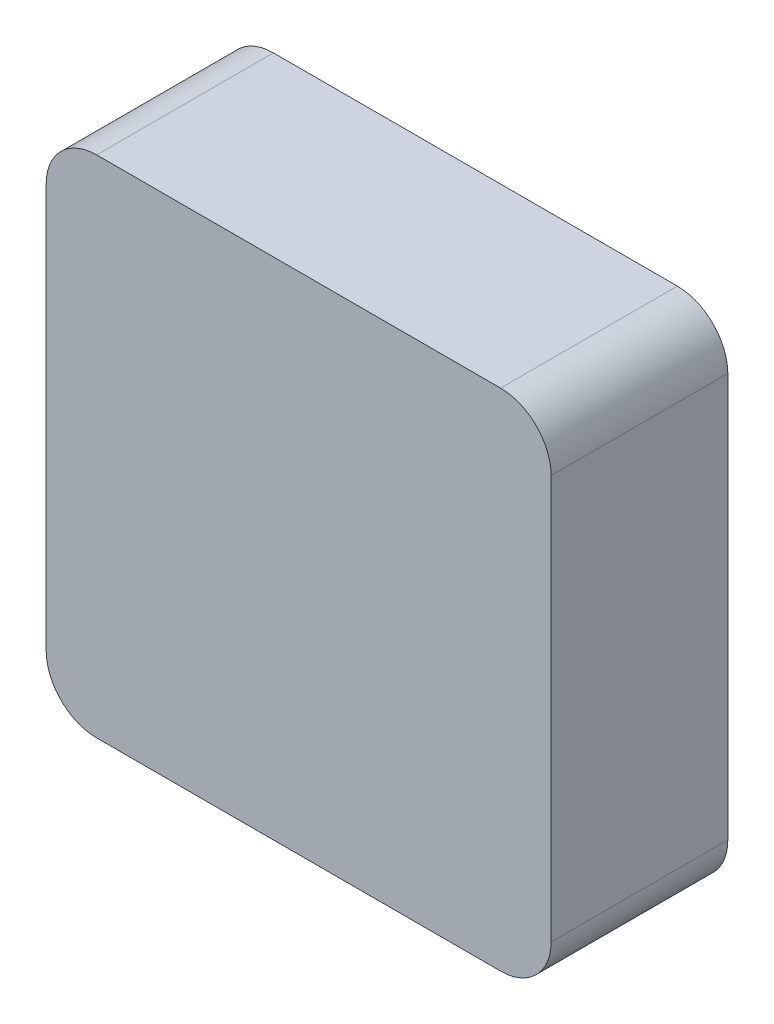
ISO-10303-21;
HEADER;
FILE_DESCRIPTION(('STEP AP214'),'2;1');
FILE_NAME('part.step','',(''),(''),'','','');
FILE_SCHEMA(('AUTOMOTIVE_DESIGN { 1 0 10303 214 1 1 1 1 }'));
ENDSEC;
DATA;
#1=APPLICATION_CONTEXT('core data for automotive mechanical design processes');
#2=APPLICATION_PROTOCOL_DEFINITION('international standard','automotive_design',2000,#1);
#3=PRODUCT_CONTEXT('',#1,'mechanical');
#4=PRODUCT('Part','Part','',(#3));
#5=PRODUCT_RELATED_PRODUCT_CATEGORY('part','',(#4));
#6=PRODUCT_DEFINITION_FORMATION('','',#4);
#7=PRODUCT_DEFINITION_CONTEXT('part definition',#1,'design');
#8=PRODUCT_DEFINITION('design','',#6,#7);
#9=PRODUCT_DEFINITION_SHAPE('','',#8);
#10=(LENGTH_UNIT() NAMED_UNIT(*) SI_UNIT(.MILLI.,.METRE.));
#11=(NAMED_UNIT(*) PLANE_ANGLE_UNIT() SI_UNIT($,.RADIAN.));
#12=(NAMED_UNIT(*) SI_UNIT($,.STERADIAN.) SOLID_ANGLE_UNIT());
#13=UNCERTAINTY_MEASURE_WITH_UNIT(LENGTH_MEASURE(1.E-05),#10,'distance_accuracy_value','');
#14=(GEOMETRIC_REPRESENTATION_CONTEXT(3) GLOBAL_UNCERTAINTY_ASSIGNED_CONTEXT((#13)) GLOBAL_UNIT_ASSIGNED_CONTEXT((#10,
#11,#12)) REPRESENTATION_CONTEXT('',''));
#15=CARTESIAN_POINT('',(0.,0.,0.));
#16=DIRECTION('',(0.,0.,1.));
#17=DIRECTION('',(1.,0.,0.));
#18=AXIS2_PLACEMENT_3D('',#15,#16,#17);
#19=CARTESIAN_POINT('',(0.,0.,35.));
#20=DIRECTION('',(1.,0.,0.));
#21=DIRECTION('',(0.,0.,-1.));
#22=AXIS2_PLACEMENT_3D('',#19,#20,#21);
#23=PLANE('',#22);
#24=DIRECTION('',(0.,-1.,0.));
#25=VECTOR('',#24,1.);
#26=CARTESIAN_POINT('',(0.,0.,35.));
#27=LINE('',#26,#25);
#28=CARTESIAN_POINT('',(0.,90.,35.));
#29=VERTEX_POINT('',#28);
#30=CARTESIAN_POINT('',(0.,10.,35.));
#31=VERTEX_POINT('',#30);
#32=EDGE_CURVE('E335',#29,#31,#27,.T.);
#33=ORIENTED_EDGE('',*,*,#32,.F.);
#34=DIRECTION('',(0.,0.,-1.));
#35=VECTOR('',#34,1.);
#36=CARTESIAN_POINT('',(0.,90.,35.));
#37=LINE('',#36,#35);
#38=CARTESIAN_POINT('',(0.,90.,0.));
#39=VERTEX_POINT('',#38);
#40=EDGE_CURVE('E360',#29,#39,#37,.T.);
#41=ORIENTED_EDGE('',*,*,#40,.T.);
#42=DIRECTION('',(0.,-1.,0.));
#43=VECTOR('',#42,1.);
#44=CARTESIAN_POINT('',(0.,0.,0.));
#45=LINE('',#44,#43);
#46=CARTESIAN_POINT('',(0.,10.,0.));
#47=VERTEX_POINT('',#46);
#48=EDGE_CURVE('E328',#39,#47,#45,.T.);
#49=ORIENTED_EDGE('',*,*,#48,.T.);
#50=DIRECTION('',(0.,0.,-1.));
#51=VECTOR('',#50,1.);
#52=CARTESIAN_POINT('',(0.,10.,35.));
#53=LINE('',#52,#51);
#54=EDGE_CURVE('E348',#47,#31,#53,.F.);
#55=ORIENTED_EDGE('',*,*,#54,.T.);
#56=EDGE_LOOP('',(#33,#41,#49,#55));
#57=FACE_BOUND('',#56,.T.);
#58=ADVANCED_FACE('F39',(#57),#23,.F.);
#59=CARTESIAN_POINT('',(0.,0.,35.));
#60=DIRECTION('',(0.,1.,0.));
#61=DIRECTION('',(0.,0.,1.));
#62=AXIS2_PLACEMENT_3D('',#59,#60,#61);
#63=PLANE('',#62);
#64=DIRECTION('',(1.,0.,0.));
#65=VECTOR('',#64,1.);
#66=CARTESIAN_POINT('',(19.2242024894603,0.,14.1517072152888));
#67=LINE('',#66,#65);
#68=CARTESIAN_POINT('',(19.2242024894603,0.,14.1517072152888));
#69=VERTEX_POINT('',#68);
#70=CARTESIAN_POINT('',(30.1952043797916,0.,14.1517072152888));
#71=VERTEX_POINT('',#70);
#72=EDGE_CURVE('E257',#69,#71,#67,.T.);
#73=ORIENTED_EDGE('',*,*,#72,.F.);
#74=DIRECTION('',(0.,0.,-1.));
#75=VECTOR('',#74,1.);
#76=CARTESIAN_POINT('',(19.2242024894603,0.,22.9380074304892));
#77=LINE('',#76,#75);
#78=CARTESIAN_POINT('',(19.2242024894603,0.,22.9380074304892));
#79=VERTEX_POINT('',#78);
#80=EDGE_CURVE('E54',#79,#69,#77,.T.);
#81=ORIENTED_EDGE('',*,*,#80,.F.);
#82=DIRECTION('',(-1.,0.,0.));
#83=VECTOR('',#82,1.);
#84=CARTESIAN_POINT('',(19.2242024894603,0.,22.9380074304892));
#85=LINE('',#84,#83);
#86=CARTESIAN_POINT('',(30.1952043797916,0.,22.9380074304892));
#87=VERTEX_POINT('',#86);
#88=EDGE_CURVE('E246',#87,#79,#85,.T.);
#89=ORIENTED_EDGE('',*,*,#88,.F.);
#90=DIRECTION('',(0.,0.,1.));
#91=VECTOR('',#90,1.);
#92=CARTESIAN_POINT('',(30.1952043797916,0.,22.9380074304892));
#93=LINE('',#92,#91);
#94=EDGE_CURVE('E261',#71,#87,#93,.T.);
#95=ORIENTED_EDGE('',*,*,#94,.F.);
#96=EDGE_LOOP('',(#73,#81,#89,#95));
#97=FACE_BOUND('',#96,.T.);
#98=DIRECTION('',(1.,0.,0.));
#99=VECTOR('',#98,1.);
#100=CARTESIAN_POINT('',(69.0448993853803,0.,14.3416812739959));
#101=LINE('',#100,#99);
#102=CARTESIAN_POINT('',(69.0448993853803,0.,14.3416812739959));
#103=VERTEX_POINT('',#102);
#104=CARTESIAN_POINT('',(80.3008623637721,0.,14.3416812739959));
#105=VERTEX_POINT('',#104);
#106=EDGE_CURVE('E289',#103,#105,#101,.T.);
#107=ORIENTED_EDGE('',*,*,#106,.F.);
#108=DIRECTION('',(0.,0.,-1.));
#109=VECTOR('',#108,1.);
#110=CARTESIAN_POINT('',(69.0448993853803,0.,17.4287597279852));
#111=LINE('',#110,#109);
#112=CARTESIAN_POINT('',(69.0448993853803,0.,17.4287597279852));
#113=VERTEX_POINT('',#112);
#114=EDGE_CURVE('E62',#113,#103,#111,.T.);
#115=ORIENTED_EDGE('',*,*,#114,.F.);
#116=DIRECTION('',(-1.,0.,0.));
#117=VECTOR('',#116,1.);
#118=CARTESIAN_POINT('',(69.0448993853803,0.,17.4287597279852));
#119=LINE('',#118,#117);
#120=CARTESIAN_POINT('',(80.3008623637721,0.,17.4287597279852));
#121=VERTEX_POINT('',#120);
#122=EDGE_CURVE('E278',#121,#113,#119,.T.);
#123=ORIENTED_EDGE('',*,*,#122,.F.);
#124=DIRECTION('',(0.,0.,1.));
#125=VECTOR('',#124,1.);
#126=CARTESIAN_POINT('',(80.3008623637721,0.,17.4287597279852));
#127=LINE('',#126,#125);
#128=EDGE_CURVE('E292',#105,#121,#127,.T.);
#129=ORIENTED_EDGE('',*,*,#128,.F.);
#130=EDGE_LOOP('',(#107,#115,#123,#129));
#131=FACE_BOUND('',#130,.T.);
#132=DIRECTION('',(1.,0.,0.));
#133=VECTOR('',#132,1.);
#134=CARTESIAN_POINT('',(55.3667671584737,0.,14.1517072152888));
#135=LINE('',#134,#133);
#136=CARTESIAN_POINT('',(55.3667671584737,0.,14.1517072152888));
#137=VERTEX_POINT('',#136);
#138=CARTESIAN_POINT('',(65.3878987552698,0.,14.1517072152888));
#139=VERTEX_POINT('',#138);
#140=EDGE_CURVE('E233',#137,#139,#135,.T.);
#141=ORIENTED_EDGE('',*,*,#140,.F.);
#142=DIRECTION('',(0.,0.,-1.));
#143=VECTOR('',#142,1.);
#144=CARTESIAN_POINT('',(55.3667671584737,0.,17.1912921546014));
#145=LINE('',#144,#143);
#146=CARTESIAN_POINT('',(55.3667671584737,0.,17.1912921546014));
#147=VERTEX_POINT('',#146);
#148=EDGE_CURVE('E207',#147,#137,#145,.T.);
#149=ORIENTED_EDGE('',*,*,#148,.F.);
#150=DIRECTION('',(-1.,0.,0.));
#151=VECTOR('',#150,1.);
#152=CARTESIAN_POINT('',(55.3667671584737,0.,17.1912921546014));
#153=LINE('',#152,#151);
#154=CARTESIAN_POINT('',(65.3878987552698,0.,17.1912921546014));
#155=VERTEX_POINT('',#154);
#156=EDGE_CURVE('E224',#155,#147,#153,.T.);
#157=ORIENTED_EDGE('',*,*,#156,.F.);
#158=DIRECTION('',(0.,0.,1.));
#159=VECTOR('',#158,1.);
#160=CARTESIAN_POINT('',(65.3878987552698,0.,17.1912921546014));
#161=LINE('',#160,#159);
#162=EDGE_CURVE('E227',#139,#155,#161,.T.);
#163=ORIENTED_EDGE('',*,*,#162,.F.);
#164=EDGE_LOOP('',(#141,#149,#157,#163));
#165=FACE_BOUND('',#164,.T.);
#166=DIRECTION('',(1.,0.,0.));
#167=VECTOR('',#166,1.);
#168=CARTESIAN_POINT('',(39.6464138004666,0.,14.0567201859353));
#169=LINE('',#168,#167);
#170=CARTESIAN_POINT('',(39.6464138004666,0.,14.0567201859353));
#171=VERTEX_POINT('',#170);
#172=CARTESIAN_POINT('',(49.0501297064648,0.,14.0567201859353));
#173=VERTEX_POINT('',#172);
#174=EDGE_CURVE('E318',#171,#173,#169,.T.);
#175=ORIENTED_EDGE('',*,*,#174,.F.);
#176=DIRECTION('',(0.,0.,-1.));
#177=VECTOR('',#176,1.);
#178=CARTESIAN_POINT('',(39.6464138004666,0.,18.4261235361971));
#179=LINE('',#178,#177);
#180=CARTESIAN_POINT('',(39.6464138004666,0.,18.4261235361971));
#181=VERTEX_POINT('',#180);
#182=EDGE_CURVE('E268',#181,#171,#179,.T.);
#183=ORIENTED_EDGE('',*,*,#182,.F.);
#184=DIRECTION('',(-1.,0.,0.));
#185=VECTOR('',#184,1.);
#186=CARTESIAN_POINT('',(39.6464138004666,0.,18.4261235361971));
#187=LINE('',#186,#185);
#188=CARTESIAN_POINT('',(49.0501297064648,0.,18.4261235361971));
#189=VERTEX_POINT('',#188);
#190=EDGE_CURVE('E307',#189,#181,#187,.T.);
#191=ORIENTED_EDGE('',*,*,#190,.F.);
#192=DIRECTION('',(0.,0.,1.));
#193=VECTOR('',#192,1.);
#194=CARTESIAN_POINT('',(49.0501297064648,0.,18.4261235361971));
#195=LINE('',#194,#193);
#196=EDGE_CURVE('E321',#173,#189,#195,.T.);
#197=ORIENTED_EDGE('',*,*,#196,.F.);
#198=EDGE_LOOP('',(#175,#183,#191,#197));
#199=FACE_BOUND('',#198,.T.);
#200=DIRECTION('',(1.,0.,0.));
#201=VECTOR('',#200,1.);
#202=CARTESIAN_POINT('',(0.,0.,35.));
#203=LINE('',#202,#201);
#204=CARTESIAN_POINT('',(10.,0.,35.));
#205=VERTEX_POINT('',#204);
#206=CARTESIAN_POINT('',(90.,0.,35.));
#207=VERTEX_POINT('',#206);
#208=EDGE_CURVE('E338',#205,#207,#203,.T.);
#209=ORIENTED_EDGE('',*,*,#208,.F.);
#210=DIRECTION('',(0.,0.,-1.));
#211=VECTOR('',#210,1.);
#212=CARTESIAN_POINT('',(10.,0.,35.));
#213=LINE('',#212,#211);
#214=CARTESIAN_POINT('',(10.,0.,0.));
#215=VERTEX_POINT('',#214);
#216=EDGE_CURVE('E386',#205,#215,#213,.T.);
#217=ORIENTED_EDGE('',*,*,#216,.T.);
#218=DIRECTION('',(1.,0.,0.));
#219=VECTOR('',#218,1.);
#220=CARTESIAN_POINT('',(0.,0.,0.));
#221=LINE('',#220,#219);
#222=CARTESIAN_POINT('',(90.,0.,0.));
#223=VERTEX_POINT('',#222);
#224=EDGE_CURVE('E351',#215,#223,#221,.T.);
#225=ORIENTED_EDGE('',*,*,#224,.T.);
#226=DIRECTION('',(0.,0.,-1.));
#227=VECTOR('',#226,1.);
#228=CARTESIAN_POINT('',(90.,0.,35.));
#229=LINE('',#228,#227);
#230=EDGE_CURVE('E384',#223,#207,#229,.F.);
#231=ORIENTED_EDGE('',*,*,#230,.T.);
#232=EDGE_LOOP('',(#209,#217,#225,#231));
#233=FACE_BOUND('',#232,.T.);
#234=ADVANCED_FACE('F422',(#97,#131,#165,#199,#233),#63,.F.);
#235=CARTESIAN_POINT('',(100.,0.,35.));
#236=DIRECTION('',(-1.,0.,0.));
#237=DIRECTION('',(0.,0.,1.));
#238=AXIS2_PLACEMENT_3D('',#235,#236,#237);
#239=PLANE('',#238);
#240=DIRECTION('',(0.,1.,0.));
#241=VECTOR('',#240,1.);
#242=CARTESIAN_POINT('',(100.,0.,35.));
#243=LINE('',#242,#241);
#244=CARTESIAN_POINT('',(100.,10.,35.));
#245=VERTEX_POINT('',#244);
#246=CARTESIAN_POINT('',(100.,90.,35.));
#247=VERTEX_POINT('',#246);
#248=EDGE_CURVE('E342',#245,#247,#243,.T.);
#249=ORIENTED_EDGE('',*,*,#248,.F.);
#250=DIRECTION('',(0.,0.,-1.));
#251=VECTOR('',#250,1.);
#252=CARTESIAN_POINT('',(100.,10.,35.));
#253=LINE('',#252,#251);
#254=CARTESIAN_POINT('',(100.,10.,0.));
#255=VERTEX_POINT('',#254);
#256=EDGE_CURVE('E11',#245,#255,#253,.T.);
#257=ORIENTED_EDGE('',*,*,#256,.T.);
#258=DIRECTION('',(0.,1.,0.));
#259=VECTOR('',#258,1.);
#260=CARTESIAN_POINT('',(100.,0.,0.));
#261=LINE('',#260,#259);
#262=CARTESIAN_POINT('',(100.,90.,0.));
#263=VERTEX_POINT('',#262);
#264=EDGE_CURVE('E354',#255,#263,#261,.T.);
#265=ORIENTED_EDGE('',*,*,#264,.T.);
#266=DIRECTION('',(0.,0.,-1.));
#267=VECTOR('',#266,1.);
#268=CARTESIAN_POINT('',(100.,90.,35.));
#269=LINE('',#268,#267);
#270=EDGE_CURVE('E47',#263,#247,#269,.F.);
#271=ORIENTED_EDGE('',*,*,#270,.T.);
#272=EDGE_LOOP('',(#249,#257,#265,#271));
#273=FACE_BOUND('',#272,.T.);
#274=ADVANCED_FACE('F391',(#273),#239,.F.);
#275=CARTESIAN_POINT('',(0.,100.,35.));
#276=DIRECTION('',(0.,-1.,0.));
#277=DIRECTION('',(0.,0.,-1.));
#278=AXIS2_PLACEMENT_3D('',#275,#276,#277);
#279=PLANE('',#278);
#280=DIRECTION('',(-1.,0.,0.));
#281=VECTOR('',#280,1.);
#282=CARTESIAN_POINT('',(0.,100.,0.));
#283=LINE('',#282,#281);
#284=CARTESIAN_POINT('',(90.,100.,0.));
#285=VERTEX_POINT('',#284);
#286=CARTESIAN_POINT('',(10.,100.,0.));
#287=VERTEX_POINT('',#286);
#288=EDGE_CURVE('E339',#285,#287,#283,.T.);
#289=ORIENTED_EDGE('',*,*,#288,.T.);
#290=DIRECTION('',(0.,0.,-1.));
#291=VECTOR('',#290,1.);
#292=CARTESIAN_POINT('',(10.,100.,35.));
#293=LINE('',#292,#291);
#294=CARTESIAN_POINT('',(10.,100.,35.));
#295=VERTEX_POINT('',#294);
#296=EDGE_CURVE('E374',#287,#295,#293,.F.);
#297=ORIENTED_EDGE('',*,*,#296,.T.);
#298=DIRECTION('',(-1.,0.,0.));
#299=VECTOR('',#298,1.);
#300=CARTESIAN_POINT('',(0.,100.,35.));
#301=LINE('',#300,#299);
#302=CARTESIAN_POINT('',(90.,100.,35.));
#303=VERTEX_POINT('',#302);
#304=EDGE_CURVE('E345',#303,#295,#301,.T.);
#305=ORIENTED_EDGE('',*,*,#304,.F.);
#306=DIRECTION('',(0.,0.,-1.));
#307=VECTOR('',#306,1.);
#308=CARTESIAN_POINT('',(90.,100.,35.));
#309=LINE('',#308,#307);
#310=EDGE_CURVE('E371',#303,#285,#309,.T.);
#311=ORIENTED_EDGE('',*,*,#310,.T.);
#312=EDGE_LOOP('',(#289,#297,#305,#311));
#313=FACE_BOUND('',#312,.T.);
#314=ADVANCED_FACE('F403',(#313),#279,.F.);
#315=CARTESIAN_POINT('',(0.,0.,35.));
#316=DIRECTION('',(0.,0.,-1.));
#317=DIRECTION('',(-1.,0.,0.));
#318=AXIS2_PLACEMENT_3D('',#315,#316,#317);
#319=PLANE('',#318);
#320=ORIENTED_EDGE('',*,*,#304,.T.);
#321=CARTESIAN_POINT('',(10.,90.,35.));
#322=DIRECTION('',(0.,0.,-1.));
#323=DIRECTION('',(-1.,0.,0.));
#324=AXIS2_PLACEMENT_3D('',#321,#322,#323);
#325=CIRCLE('',#324,10.);
#326=EDGE_CURVE('E382',#295,#29,#325,.F.);
#327=ORIENTED_EDGE('',*,*,#326,.T.);
#328=ORIENTED_EDGE('',*,*,#32,.T.);
#329=CARTESIAN_POINT('',(10.,10.,35.));
#330=DIRECTION('',(0.,0.,-1.));
#331=DIRECTION('',(-1.,0.,0.));
#332=AXIS2_PLACEMENT_3D('',#329,#330,#331);
#333=CIRCLE('',#332,10.);
#334=EDGE_CURVE('E380',#31,#205,#333,.F.);
#335=ORIENTED_EDGE('',*,*,#334,.T.);
#336=ORIENTED_EDGE('',*,*,#208,.T.);
#337=CARTESIAN_POINT('',(90.,10.,35.));
#338=DIRECTION('',(0.,0.,-1.));
#339=DIRECTION('',(-1.,0.,0.));
#340=AXIS2_PLACEMENT_3D('',#337,#338,#339);
#341=CIRCLE('',#340,10.);
#342=EDGE_CURVE('E378',#207,#245,#341,.F.);
#343=ORIENTED_EDGE('',*,*,#342,.T.);
#344=ORIENTED_EDGE('',*,*,#248,.T.);
#345=CARTESIAN_POINT('',(90.,90.,35.));
#346=DIRECTION('',(0.,0.,-1.));
#347=DIRECTION('',(-1.,0.,0.));
#348=AXIS2_PLACEMENT_3D('',#345,#346,#347);
#349=CIRCLE('',#348,10.);
#350=EDGE_CURVE('E376',#247,#303,#349,.F.);
#351=ORIENTED_EDGE('',*,*,#350,.T.);
#352=EDGE_LOOP('',(#320,#327,#328,#335,#336,#343,#344,#351));
#353=FACE_BOUND('',#352,.T.);
#354=ADVANCED_FACE('F397',(#353),#319,.F.);
#355=CARTESIAN_POINT('',(0.,0.,0.));
#356=DIRECTION('',(0.,0.,-1.));
#357=DIRECTION('',(-1.,0.,0.));
#358=AXIS2_PLACEMENT_3D('',#355,#356,#357);
#359=PLANE('',#358);
#360=ORIENTED_EDGE('',*,*,#48,.F.);
#361=CARTESIAN_POINT('',(10.,90.,0.));
#362=DIRECTION('',(0.,0.,-1.));
#363=DIRECTION('',(-1.,0.,0.));
#364=AXIS2_PLACEMENT_3D('',#361,#362,#363);
#365=CIRCLE('',#364,10.);
#366=EDGE_CURVE('E369',#39,#287,#365,.T.);
#367=ORIENTED_EDGE('',*,*,#366,.T.);
#368=ORIENTED_EDGE('',*,*,#288,.F.);
#369=CARTESIAN_POINT('',(90.,90.,0.));
#370=DIRECTION('',(0.,0.,-1.));
#371=DIRECTION('',(-1.,0.,0.));
#372=AXIS2_PLACEMENT_3D('',#369,#370,#371);
#373=CIRCLE('',#372,10.);
#374=EDGE_CURVE('E363',#285,#263,#373,.T.);
#375=ORIENTED_EDGE('',*,*,#374,.T.);
#376=ORIENTED_EDGE('',*,*,#264,.F.);
#377=CARTESIAN_POINT('',(90.,10.,0.));
#378=DIRECTION('',(0.,0.,-1.));
#379=DIRECTION('',(-1.,0.,0.));
#380=AXIS2_PLACEMENT_3D('',#377,#378,#379);
#381=CIRCLE('',#380,10.);
#382=EDGE_CURVE('E365',#255,#223,#381,.T.);
#383=ORIENTED_EDGE('',*,*,#382,.T.);
#384=ORIENTED_EDGE('',*,*,#224,.F.);
#385=CARTESIAN_POINT('',(10.,10.,0.));
#386=DIRECTION('',(0.,0.,-1.));
#387=DIRECTION('',(-1.,0.,0.));
#388=AXIS2_PLACEMENT_3D('',#385,#386,#387);
#389=CIRCLE('',#388,10.);
#390=EDGE_CURVE('E367',#215,#47,#389,.T.);
#391=ORIENTED_EDGE('',*,*,#390,.T.);
#392=EDGE_LOOP('',(#360,#367,#368,#375,#376,#383,#384,#391));
#393=FACE_BOUND('',#392,.T.);
#394=ADVANCED_FACE('F407',(#393),#359,.T.);
#395=CARTESIAN_POINT('',(10.,90.,35.));
#396=DIRECTION('',(0.,0.,-1.));
#397=DIRECTION('',(-1.,0.,0.));
#398=AXIS2_PLACEMENT_3D('',#395,#396,#397);
#399=CYLINDRICAL_SURFACE('',#398,10.);
#400=ORIENTED_EDGE('',*,*,#326,.F.);
#401=ORIENTED_EDGE('',*,*,#296,.F.);
#402=ORIENTED_EDGE('',*,*,#366,.F.);
#403=ORIENTED_EDGE('',*,*,#40,.F.);
#404=EDGE_LOOP('',(#400,#401,#402,#403));
#405=FACE_BOUND('',#404,.T.);
#406=ADVANCED_FACE('F411',(#405),#399,.T.);
#407=CARTESIAN_POINT('',(10.,10.,35.));
#408=DIRECTION('',(0.,0.,-1.));
#409=DIRECTION('',(-1.,0.,0.));
#410=AXIS2_PLACEMENT_3D('',#407,#408,#409);
#411=CYLINDRICAL_SURFACE('',#410,10.);
#412=ORIENTED_EDGE('',*,*,#334,.F.);
#413=ORIENTED_EDGE('',*,*,#54,.F.);
#414=ORIENTED_EDGE('',*,*,#390,.F.);
#415=ORIENTED_EDGE('',*,*,#216,.F.);
#416=EDGE_LOOP('',(#412,#413,#414,#415));
#417=FACE_BOUND('',#416,.T.);
#418=ADVANCED_FACE('F419',(#417),#411,.T.);
#419=CARTESIAN_POINT('',(90.,10.,35.));
#420=DIRECTION('',(0.,0.,-1.));
#421=DIRECTION('',(-1.,0.,0.));
#422=AXIS2_PLACEMENT_3D('',#419,#420,#421);
#423=CYLINDRICAL_SURFACE('',#422,10.);
#424=ORIENTED_EDGE('',*,*,#342,.F.);
#425=ORIENTED_EDGE('',*,*,#230,.F.);
#426=ORIENTED_EDGE('',*,*,#382,.F.);
#427=ORIENTED_EDGE('',*,*,#256,.F.);
#428=EDGE_LOOP('',(#424,#425,#426,#427));
#429=FACE_BOUND('',#428,.T.);
#430=ADVANCED_FACE('F425',(#429),#423,.T.);
#431=CARTESIAN_POINT('',(90.,90.,35.));
#432=DIRECTION('',(0.,0.,-1.));
#433=DIRECTION('',(-1.,0.,0.));
#434=AXIS2_PLACEMENT_3D('',#431,#432,#433);
#435=CYLINDRICAL_SURFACE('',#434,10.);
#436=ORIENTED_EDGE('',*,*,#350,.F.);
#437=ORIENTED_EDGE('',*,*,#270,.F.);
#438=ORIENTED_EDGE('',*,*,#374,.F.);
#439=ORIENTED_EDGE('',*,*,#310,.F.);
#440=EDGE_LOOP('',(#436,#437,#438,#439));
#441=FACE_BOUND('',#440,.T.);
#442=ADVANCED_FACE('F41',(#441),#435,.T.);
#443=CARTESIAN_POINT('',(39.6464138004666,5.,18.4261235361971));
#444=DIRECTION('',(-1.,0.,0.));
#445=DIRECTION('',(0.,0.,1.));
#446=AXIS2_PLACEMENT_3D('',#443,#444,#445);
#447=PLANE('',#446);
#448=ORIENTED_EDGE('',*,*,#182,.T.);
#449=DIRECTION('',(0.,-1.,0.));
#450=VECTOR('',#449,1.);
#451=CARTESIAN_POINT('',(39.6464138004666,5.,14.0567201859353));
#452=LINE('',#451,#450);
#453=CARTESIAN_POINT('',(39.6464138004666,5.,14.0567201859353));
#454=VERTEX_POINT('',#453);
#455=EDGE_CURVE('E316',#454,#171,#452,.T.);
#456=ORIENTED_EDGE('',*,*,#455,.F.);
#457=DIRECTION('',(0.,0.,-1.));
#458=VECTOR('',#457,1.);
#459=CARTESIAN_POINT('',(39.6464138004666,5.,18.4261235361971));
#460=LINE('',#459,#458);
#461=CARTESIAN_POINT('',(39.6464138004666,5.,18.4261235361971));
#462=VERTEX_POINT('',#461);
#463=EDGE_CURVE('E303',#462,#454,#460,.T.);
#464=ORIENTED_EDGE('',*,*,#463,.F.);
#465=DIRECTION('',(0.,-1.,0.));
#466=VECTOR('',#465,1.);
#467=CARTESIAN_POINT('',(39.6464138004666,5.,18.4261235361971));
#468=LINE('',#467,#466);
#469=EDGE_CURVE('E326',#462,#181,#468,.T.);
#470=ORIENTED_EDGE('',*,*,#469,.T.);
#471=EDGE_LOOP('',(#448,#456,#464,#470));
#472=FACE_BOUND('',#471,.T.);
#473=ADVANCED_FACE('F431',(#472),#447,.F.);
#474=CARTESIAN_POINT('',(39.6464138004666,5.,18.4261235361971));
#475=DIRECTION('',(0.,0.,1.));
#476=DIRECTION('',(1.,0.,0.));
#477=AXIS2_PLACEMENT_3D('',#474,#475,#476);
#478=PLANE('',#477);
#479=ORIENTED_EDGE('',*,*,#190,.T.);
#480=ORIENTED_EDGE('',*,*,#469,.F.);
#481=DIRECTION('',(-1.,0.,0.));
#482=VECTOR('',#481,1.);
#483=CARTESIAN_POINT('',(39.6464138004666,5.,18.4261235361971));
#484=LINE('',#483,#482);
#485=CARTESIAN_POINT('',(49.0501297064648,5.,18.4261235361971));
#486=VERTEX_POINT('',#485);
#487=EDGE_CURVE('E313',#486,#462,#484,.T.);
#488=ORIENTED_EDGE('',*,*,#487,.F.);
#489=DIRECTION('',(0.,-1.,0.));
#490=VECTOR('',#489,1.);
#491=CARTESIAN_POINT('',(49.0501297064648,5.,18.4261235361971));
#492=LINE('',#491,#490);
#493=EDGE_CURVE('E329',#486,#189,#492,.T.);
#494=ORIENTED_EDGE('',*,*,#493,.T.);
#495=EDGE_LOOP('',(#479,#480,#488,#494));
#496=FACE_BOUND('',#495,.T.);
#497=ADVANCED_FACE('F505',(#496),#478,.F.);
#498=CARTESIAN_POINT('',(49.0501297064648,5.,18.4261235361971));
#499=DIRECTION('',(1.,0.,0.));
#500=DIRECTION('',(0.,0.,-1.));
#501=AXIS2_PLACEMENT_3D('',#498,#499,#500);
#502=PLANE('',#501);
#503=ORIENTED_EDGE('',*,*,#196,.T.);
#504=ORIENTED_EDGE('',*,*,#493,.F.);
#505=DIRECTION('',(0.,0.,1.));
#506=VECTOR('',#505,1.);
#507=CARTESIAN_POINT('',(49.0501297064648,5.,18.4261235361971));
#508=LINE('',#507,#506);
#509=CARTESIAN_POINT('',(49.0501297064648,5.,14.0567201859353));
#510=VERTEX_POINT('',#509);
#511=EDGE_CURVE('E310',#510,#486,#508,.T.);
#512=ORIENTED_EDGE('',*,*,#511,.F.);
#513=DIRECTION('',(0.,-1.,0.));
#514=VECTOR('',#513,1.);
#515=CARTESIAN_POINT('',(49.0501297064648,5.,14.0567201859353));
#516=LINE('',#515,#514);
#517=EDGE_CURVE('E331',#510,#173,#516,.T.);
#518=ORIENTED_EDGE('',*,*,#517,.T.);
#519=EDGE_LOOP('',(#503,#504,#512,#518));
#520=FACE_BOUND('',#519,.T.);
#521=ADVANCED_FACE('F514',(#520),#502,.F.);
#522=CARTESIAN_POINT('',(39.6464138004666,5.,14.0567201859353));
#523=DIRECTION('',(0.,0.,-1.));
#524=DIRECTION('',(-1.,0.,0.));
#525=AXIS2_PLACEMENT_3D('',#522,#523,#524);
#526=PLANE('',#525);
#527=ORIENTED_EDGE('',*,*,#174,.T.);
#528=ORIENTED_EDGE('',*,*,#517,.F.);
#529=DIRECTION('',(1.,0.,0.));
#530=VECTOR('',#529,1.);
#531=CARTESIAN_POINT('',(39.6464138004666,5.,14.0567201859353));
#532=LINE('',#531,#530);
#533=EDGE_CURVE('E306',#454,#510,#532,.T.);
#534=ORIENTED_EDGE('',*,*,#533,.F.);
#535=ORIENTED_EDGE('',*,*,#455,.T.);
#536=EDGE_LOOP('',(#527,#528,#534,#535));
#537=FACE_BOUND('',#536,.T.);
#538=ADVANCED_FACE('F524',(#537),#526,.F.);
#539=CARTESIAN_POINT('',(0.,5.,0.));
#540=DIRECTION('',(0.,-1.,0.));
#541=DIRECTION('',(0.,0.,-1.));
#542=AXIS2_PLACEMENT_3D('',#539,#540,#541);
#543=PLANE('',#542);
#544=ORIENTED_EDGE('',*,*,#463,.T.);
#545=ORIENTED_EDGE('',*,*,#533,.T.);
#546=ORIENTED_EDGE('',*,*,#511,.T.);
#547=ORIENTED_EDGE('',*,*,#487,.T.);
#548=EDGE_LOOP('',(#544,#545,#546,#547));
#549=FACE_BOUND('',#548,.T.);
#550=ADVANCED_FACE('F534',(#549),#543,.T.);
#551=CARTESIAN_POINT('',(55.3667671584737,5.,17.1912921546014));
#552=DIRECTION('',(-1.,0.,0.));
#553=DIRECTION('',(0.,0.,1.));
#554=AXIS2_PLACEMENT_3D('',#551,#552,#553);
#555=PLANE('',#554);
#556=ORIENTED_EDGE('',*,*,#148,.T.);
#557=DIRECTION('',(0.,-1.,0.));
#558=VECTOR('',#557,1.);
#559=CARTESIAN_POINT('',(55.3667671584737,5.,14.1517072152888));
#560=LINE('',#559,#558);
#561=CARTESIAN_POINT('',(55.3667671584737,5.,14.1517072152888));
#562=VERTEX_POINT('',#561);
#563=EDGE_CURVE('E200',#562,#137,#560,.T.);
#564=ORIENTED_EDGE('',*,*,#563,.F.);
#565=DIRECTION('',(0.,0.,-1.));
#566=VECTOR('',#565,1.);
#567=CARTESIAN_POINT('',(55.3667671584737,5.,17.1912921546014));
#568=LINE('',#567,#566);
#569=CARTESIAN_POINT('',(55.3667671584737,5.,17.1912921546014));
#570=VERTEX_POINT('',#569);
#571=EDGE_CURVE('E204',#570,#562,#568,.T.);
#572=ORIENTED_EDGE('',*,*,#571,.F.);
#573=DIRECTION('',(0.,-1.,0.));
#574=VECTOR('',#573,1.);
#575=CARTESIAN_POINT('',(55.3667671584737,5.,17.1912921546014));
#576=LINE('',#575,#574);
#577=EDGE_CURVE('E237',#570,#147,#576,.T.);
#578=ORIENTED_EDGE('',*,*,#577,.T.);
#579=EDGE_LOOP('',(#556,#564,#572,#578));
#580=FACE_BOUND('',#579,.T.);
#581=ADVANCED_FACE('F202',(#580),#555,.F.);
#582=CARTESIAN_POINT('',(55.3667671584737,5.,17.1912921546014));
#583=DIRECTION('',(0.,0.,1.));
#584=DIRECTION('',(1.,0.,0.));
#585=AXIS2_PLACEMENT_3D('',#582,#583,#584);
#586=PLANE('',#585);
#587=ORIENTED_EDGE('',*,*,#156,.T.);
#588=ORIENTED_EDGE('',*,*,#577,.F.);
#589=DIRECTION('',(-1.,0.,0.));
#590=VECTOR('',#589,1.);
#591=CARTESIAN_POINT('',(55.3667671584737,5.,17.1912921546014));
#592=LINE('',#591,#590);
#593=CARTESIAN_POINT('',(65.3878987552698,5.,17.1912921546014));
#594=VERTEX_POINT('',#593);
#595=EDGE_CURVE('E212',#594,#570,#592,.T.);
#596=ORIENTED_EDGE('',*,*,#595,.F.);
#597=DIRECTION('',(0.,-1.,0.));
#598=VECTOR('',#597,1.);
#599=CARTESIAN_POINT('',(65.3878987552698,5.,17.1912921546014));
#600=LINE('',#599,#598);
#601=EDGE_CURVE('E239',#594,#155,#600,.T.);
#602=ORIENTED_EDGE('',*,*,#601,.T.);
#603=EDGE_LOOP('',(#587,#588,#596,#602));
#604=FACE_BOUND('',#603,.T.);
#605=ADVANCED_FACE('F553',(#604),#586,.F.);
#606=CARTESIAN_POINT('',(65.3878987552698,5.,17.1912921546014));
#607=DIRECTION('',(1.,0.,0.));
#608=DIRECTION('',(0.,0.,-1.));
#609=AXIS2_PLACEMENT_3D('',#606,#607,#608);
#610=PLANE('',#609);
#611=ORIENTED_EDGE('',*,*,#162,.T.);
#612=ORIENTED_EDGE('',*,*,#601,.F.);
#613=DIRECTION('',(0.,0.,1.));
#614=VECTOR('',#613,1.);
#615=CARTESIAN_POINT('',(65.3878987552698,5.,17.1912921546014));
#616=LINE('',#615,#614);
#617=CARTESIAN_POINT('',(65.3878987552698,5.,14.1517072152888));
#618=VERTEX_POINT('',#617);
#619=EDGE_CURVE('E220',#618,#594,#616,.T.);
#620=ORIENTED_EDGE('',*,*,#619,.F.);
#621=DIRECTION('',(0.,-1.,0.));
#622=VECTOR('',#621,1.);
#623=CARTESIAN_POINT('',(65.3878987552698,5.,14.1517072152888));
#624=LINE('',#623,#622);
#625=EDGE_CURVE('E211',#618,#139,#624,.T.);
#626=ORIENTED_EDGE('',*,*,#625,.T.);
#627=EDGE_LOOP('',(#611,#612,#620,#626));
#628=FACE_BOUND('',#627,.T.);
#629=ADVANCED_FACE('F562',(#628),#610,.F.);
#630=CARTESIAN_POINT('',(55.3667671584737,5.,14.1517072152888));
#631=DIRECTION('',(0.,0.,-1.));
#632=DIRECTION('',(-1.,0.,0.));
#633=AXIS2_PLACEMENT_3D('',#630,#631,#632);
#634=PLANE('',#633);
#635=ORIENTED_EDGE('',*,*,#140,.T.);
#636=ORIENTED_EDGE('',*,*,#625,.F.);
#637=DIRECTION('',(1.,0.,0.));
#638=VECTOR('',#637,1.);
#639=CARTESIAN_POINT('',(55.3667671584737,5.,14.1517072152888));
#640=LINE('',#639,#638);
#641=EDGE_CURVE('E215',#562,#618,#640,.T.);
#642=ORIENTED_EDGE('',*,*,#641,.F.);
#643=ORIENTED_EDGE('',*,*,#563,.T.);
#644=EDGE_LOOP('',(#635,#636,#642,#643));
#645=FACE_BOUND('',#644,.T.);
#646=ADVANCED_FACE('F216',(#645),#634,.F.);
#647=CARTESIAN_POINT('',(0.,5.,0.));
#648=DIRECTION('',(0.,-1.,0.));
#649=DIRECTION('',(0.,0.,-1.));
#650=AXIS2_PLACEMENT_3D('',#647,#648,#649);
#651=PLANE('',#650);
#652=ORIENTED_EDGE('',*,*,#571,.T.);
#653=ORIENTED_EDGE('',*,*,#641,.T.);
#654=ORIENTED_EDGE('',*,*,#619,.T.);
#655=ORIENTED_EDGE('',*,*,#595,.T.);
#656=EDGE_LOOP('',(#652,#653,#654,#655));
#657=FACE_BOUND('',#656,.T.);
#658=ADVANCED_FACE('F222',(#657),#651,.T.);
#659=CARTESIAN_POINT('',(69.0448993853803,5.,17.4287597279852));
#660=DIRECTION('',(-1.,0.,0.));
#661=DIRECTION('',(0.,0.,1.));
#662=AXIS2_PLACEMENT_3D('',#659,#660,#661);
#663=PLANE('',#662);
#664=ORIENTED_EDGE('',*,*,#114,.T.);
#665=DIRECTION('',(0.,-1.,0.));
#666=VECTOR('',#665,1.);
#667=CARTESIAN_POINT('',(69.0448993853803,5.,14.3416812739959));
#668=LINE('',#667,#666);
#669=CARTESIAN_POINT('',(69.0448993853803,5.,14.3416812739959));
#670=VERTEX_POINT('',#669);
#671=EDGE_CURVE('E287',#670,#103,#668,.T.);
#672=ORIENTED_EDGE('',*,*,#671,.F.);
#673=DIRECTION('',(0.,0.,-1.));
#674=VECTOR('',#673,1.);
#675=CARTESIAN_POINT('',(69.0448993853803,5.,17.4287597279852));
#676=LINE('',#675,#674);
#677=CARTESIAN_POINT('',(69.0448993853803,5.,17.4287597279852));
#678=VERTEX_POINT('',#677);
#679=EDGE_CURVE('E274',#678,#670,#676,.T.);
#680=ORIENTED_EDGE('',*,*,#679,.F.);
#681=DIRECTION('',(0.,-1.,0.));
#682=VECTOR('',#681,1.);
#683=CARTESIAN_POINT('',(69.0448993853803,5.,17.4287597279852));
#684=LINE('',#683,#682);
#685=EDGE_CURVE('E258',#678,#113,#684,.T.);
#686=ORIENTED_EDGE('',*,*,#685,.T.);
#687=EDGE_LOOP('',(#664,#672,#680,#686));
#688=FACE_BOUND('',#687,.T.);
#689=ADVANCED_FACE('F589',(#688),#663,.F.);
#690=CARTESIAN_POINT('',(69.0448993853803,5.,17.4287597279852));
#691=DIRECTION('',(0.,0.,1.));
#692=DIRECTION('',(1.,0.,0.));
#693=AXIS2_PLACEMENT_3D('',#690,#691,#692);
#694=PLANE('',#693);
#695=ORIENTED_EDGE('',*,*,#122,.T.);
#696=ORIENTED_EDGE('',*,*,#685,.F.);
#697=DIRECTION('',(-1.,0.,0.));
#698=VECTOR('',#697,1.);
#699=CARTESIAN_POINT('',(69.0448993853803,5.,17.4287597279852));
#700=LINE('',#699,#698);
#701=CARTESIAN_POINT('',(80.3008623637721,5.,17.4287597279852));
#702=VERTEX_POINT('',#701);
#703=EDGE_CURVE('E284',#702,#678,#700,.T.);
#704=ORIENTED_EDGE('',*,*,#703,.F.);
#705=DIRECTION('',(0.,-1.,0.));
#706=VECTOR('',#705,1.);
#707=CARTESIAN_POINT('',(80.3008623637721,5.,17.4287597279852));
#708=LINE('',#707,#706);
#709=EDGE_CURVE('E298',#702,#121,#708,.T.);
#710=ORIENTED_EDGE('',*,*,#709,.T.);
#711=EDGE_LOOP('',(#695,#696,#704,#710));
#712=FACE_BOUND('',#711,.T.);
#713=ADVANCED_FACE('F598',(#712),#694,.F.);
#714=CARTESIAN_POINT('',(80.3008623637721,5.,17.4287597279852));
#715=DIRECTION('',(1.,0.,0.));
#716=DIRECTION('',(0.,0.,-1.));
#717=AXIS2_PLACEMENT_3D('',#714,#715,#716);
#718=PLANE('',#717);
#719=ORIENTED_EDGE('',*,*,#128,.T.);
#720=ORIENTED_EDGE('',*,*,#709,.F.);
#721=DIRECTION('',(0.,0.,1.));
#722=VECTOR('',#721,1.);
#723=CARTESIAN_POINT('',(80.3008623637721,5.,17.4287597279852));
#724=LINE('',#723,#722);
#725=CARTESIAN_POINT('',(80.3008623637721,5.,14.3416812739959));
#726=VERTEX_POINT('',#725);
#727=EDGE_CURVE('E281',#726,#702,#724,.T.);
#728=ORIENTED_EDGE('',*,*,#727,.F.);
#729=DIRECTION('',(0.,-1.,0.));
#730=VECTOR('',#729,1.);
#731=CARTESIAN_POINT('',(80.3008623637721,5.,14.3416812739959));
#732=LINE('',#731,#730);
#733=EDGE_CURVE('E300',#726,#105,#732,.T.);
#734=ORIENTED_EDGE('',*,*,#733,.T.);
#735=EDGE_LOOP('',(#719,#720,#728,#734));
#736=FACE_BOUND('',#735,.T.);
#737=ADVANCED_FACE('F607',(#736),#718,.F.);
#738=CARTESIAN_POINT('',(69.0448993853803,5.,14.3416812739959));
#739=DIRECTION('',(0.,0.,-1.));
#740=DIRECTION('',(-1.,0.,0.));
#741=AXIS2_PLACEMENT_3D('',#738,#739,#740);
#742=PLANE('',#741);
#743=ORIENTED_EDGE('',*,*,#106,.T.);
#744=ORIENTED_EDGE('',*,*,#733,.F.);
#745=DIRECTION('',(1.,0.,0.));
#746=VECTOR('',#745,1.);
#747=CARTESIAN_POINT('',(69.0448993853803,5.,14.3416812739959));
#748=LINE('',#747,#746);
#749=EDGE_CURVE('E277',#670,#726,#748,.T.);
#750=ORIENTED_EDGE('',*,*,#749,.F.);
#751=ORIENTED_EDGE('',*,*,#671,.T.);
#752=EDGE_LOOP('',(#743,#744,#750,#751));
#753=FACE_BOUND('',#752,.T.);
#754=ADVANCED_FACE('F617',(#753),#742,.F.);
#755=CARTESIAN_POINT('',(0.,5.,0.));
#756=DIRECTION('',(0.,-1.,0.));
#757=DIRECTION('',(0.,0.,-1.));
#758=AXIS2_PLACEMENT_3D('',#755,#756,#757);
#759=PLANE('',#758);
#760=ORIENTED_EDGE('',*,*,#679,.T.);
#761=ORIENTED_EDGE('',*,*,#749,.T.);
#762=ORIENTED_EDGE('',*,*,#727,.T.);
#763=ORIENTED_EDGE('',*,*,#703,.T.);
#764=EDGE_LOOP('',(#760,#761,#762,#763));
#765=FACE_BOUND('',#764,.T.);
#766=ADVANCED_FACE('F627',(#765),#759,.T.);
#767=CARTESIAN_POINT('',(19.2242024894603,5.,22.9380074304892));
#768=DIRECTION('',(-1.,0.,0.));
#769=DIRECTION('',(0.,0.,1.));
#770=AXIS2_PLACEMENT_3D('',#767,#768,#769);
#771=PLANE('',#770);
#772=ORIENTED_EDGE('',*,*,#80,.T.);
#773=DIRECTION('',(0.,-1.,0.));
#774=VECTOR('',#773,1.);
#775=CARTESIAN_POINT('',(19.2242024894603,5.,14.1517072152888));
#776=LINE('',#775,#774);
#777=CARTESIAN_POINT('',(19.2242024894603,5.,14.1517072152888));
#778=VERTEX_POINT('',#777);
#779=EDGE_CURVE('E255',#778,#69,#776,.T.);
#780=ORIENTED_EDGE('',*,*,#779,.F.);
#781=DIRECTION('',(0.,0.,-1.));
#782=VECTOR('',#781,1.);
#783=CARTESIAN_POINT('',(19.2242024894603,5.,22.9380074304892));
#784=LINE('',#783,#782);
#785=CARTESIAN_POINT('',(19.2242024894603,5.,22.9380074304892));
#786=VERTEX_POINT('',#785);
#787=EDGE_CURVE('E242',#786,#778,#784,.T.);
#788=ORIENTED_EDGE('',*,*,#787,.F.);
#789=DIRECTION('',(0.,-1.,0.));
#790=VECTOR('',#789,1.);
#791=CARTESIAN_POINT('',(19.2242024894603,5.,22.9380074304892));
#792=LINE('',#791,#790);
#793=EDGE_CURVE('E266',#786,#79,#792,.T.);
#794=ORIENTED_EDGE('',*,*,#793,.T.);
#795=EDGE_LOOP('',(#772,#780,#788,#794));
#796=FACE_BOUND('',#795,.T.);
#797=ADVANCED_FACE('F637',(#796),#771,.F.);
#798=CARTESIAN_POINT('',(19.2242024894603,5.,22.9380074304892));
#799=DIRECTION('',(0.,0.,1.));
#800=DIRECTION('',(1.,0.,0.));
#801=AXIS2_PLACEMENT_3D('',#798,#799,#800);
#802=PLANE('',#801);
#803=ORIENTED_EDGE('',*,*,#88,.T.);
#804=ORIENTED_EDGE('',*,*,#793,.F.);
#805=DIRECTION('',(-1.,0.,0.));
#806=VECTOR('',#805,1.);
#807=CARTESIAN_POINT('',(19.2242024894603,5.,22.9380074304892));
#808=LINE('',#807,#806);
#809=CARTESIAN_POINT('',(30.1952043797916,5.,22.9380074304892));
#810=VERTEX_POINT('',#809);
#811=EDGE_CURVE('E252',#810,#786,#808,.T.);
#812=ORIENTED_EDGE('',*,*,#811,.F.);
#813=DIRECTION('',(0.,-1.,0.));
#814=VECTOR('',#813,1.);
#815=CARTESIAN_POINT('',(30.1952043797916,5.,22.9380074304892));
#816=LINE('',#815,#814);
#817=EDGE_CURVE('E269',#810,#87,#816,.T.);
#818=ORIENTED_EDGE('',*,*,#817,.T.);
#819=EDGE_LOOP('',(#803,#804,#812,#818));
#820=FACE_BOUND('',#819,.T.);
#821=ADVANCED_FACE('F647',(#820),#802,.F.);
#822=CARTESIAN_POINT('',(30.1952043797916,5.,22.9380074304892));
#823=DIRECTION('',(1.,0.,0.));
#824=DIRECTION('',(0.,0.,-1.));
#825=AXIS2_PLACEMENT_3D('',#822,#823,#824);
#826=PLANE('',#825);
#827=ORIENTED_EDGE('',*,*,#94,.T.);
#828=ORIENTED_EDGE('',*,*,#817,.F.);
#829=DIRECTION('',(0.,0.,1.));
#830=VECTOR('',#829,1.);
#831=CARTESIAN_POINT('',(30.1952043797916,5.,22.9380074304892));
#832=LINE('',#831,#830);
#833=CARTESIAN_POINT('',(30.1952043797916,5.,14.1517072152888));
#834=VERTEX_POINT('',#833);
#835=EDGE_CURVE('E249',#834,#810,#832,.T.);
#836=ORIENTED_EDGE('',*,*,#835,.F.);
#837=DIRECTION('',(0.,-1.,0.));
#838=VECTOR('',#837,1.);
#839=CARTESIAN_POINT('',(30.1952043797916,5.,14.1517072152888));
#840=LINE('',#839,#838);
#841=EDGE_CURVE('E271',#834,#71,#840,.T.);
#842=ORIENTED_EDGE('',*,*,#841,.T.);
#843=EDGE_LOOP('',(#827,#828,#836,#842));
#844=FACE_BOUND('',#843,.T.);
#845=ADVANCED_FACE('F656',(#844),#826,.F.);
#846=CARTESIAN_POINT('',(19.2242024894603,5.,14.1517072152888));
#847=DIRECTION('',(0.,0.,-1.));
#848=DIRECTION('',(-1.,0.,0.));
#849=AXIS2_PLACEMENT_3D('',#846,#847,#848);
#850=PLANE('',#849);
#851=ORIENTED_EDGE('',*,*,#72,.T.);
#852=ORIENTED_EDGE('',*,*,#841,.F.);
#853=DIRECTION('',(1.,0.,0.));
#854=VECTOR('',#853,1.);
#855=CARTESIAN_POINT('',(19.2242024894603,5.,14.1517072152888));
#856=LINE('',#855,#854);
#857=EDGE_CURVE('E245',#778,#834,#856,.T.);
#858=ORIENTED_EDGE('',*,*,#857,.F.);
#859=ORIENTED_EDGE('',*,*,#779,.T.);
#860=EDGE_LOOP('',(#851,#852,#858,#859));
#861=FACE_BOUND('',#860,.T.);
#862=ADVANCED_FACE('F666',(#861),#850,.F.);
#863=CARTESIAN_POINT('',(0.,5.,0.));
#864=DIRECTION('',(0.,-1.,0.));
#865=DIRECTION('',(0.,0.,-1.));
#866=AXIS2_PLACEMENT_3D('',#863,#864,#865);
#867=PLANE('',#866);
#868=ORIENTED_EDGE('',*,*,#787,.T.);
#869=ORIENTED_EDGE('',*,*,#857,.T.);
#870=ORIENTED_EDGE('',*,*,#835,.T.);
#871=ORIENTED_EDGE('',*,*,#811,.T.);
#872=EDGE_LOOP('',(#868,#869,#870,#871));
#873=FACE_BOUND('',#872,.T.);
#874=ADVANCED_FACE('F676',(#873),#867,.T.);
#875=CLOSED_SHELL('',(#58,#234,#274,#314,#354,#394,#406,#418,#430,#442,#473,#497,#521,#538,#550,
#581,#605,#629,#646,#658,#689,#713,#737,#754,#766,#797,#821,#845,#862,#874));
#876=MANIFOLD_SOLID_BREP('B2',#875);
#877=ADVANCED_BREP_SHAPE_REPRESENTATION('',(#18,#876),#14);
#878=SHAPE_DEFINITION_REPRESENTATION(#9,#877);
ENDSEC;
END-ISO-10303-21;
